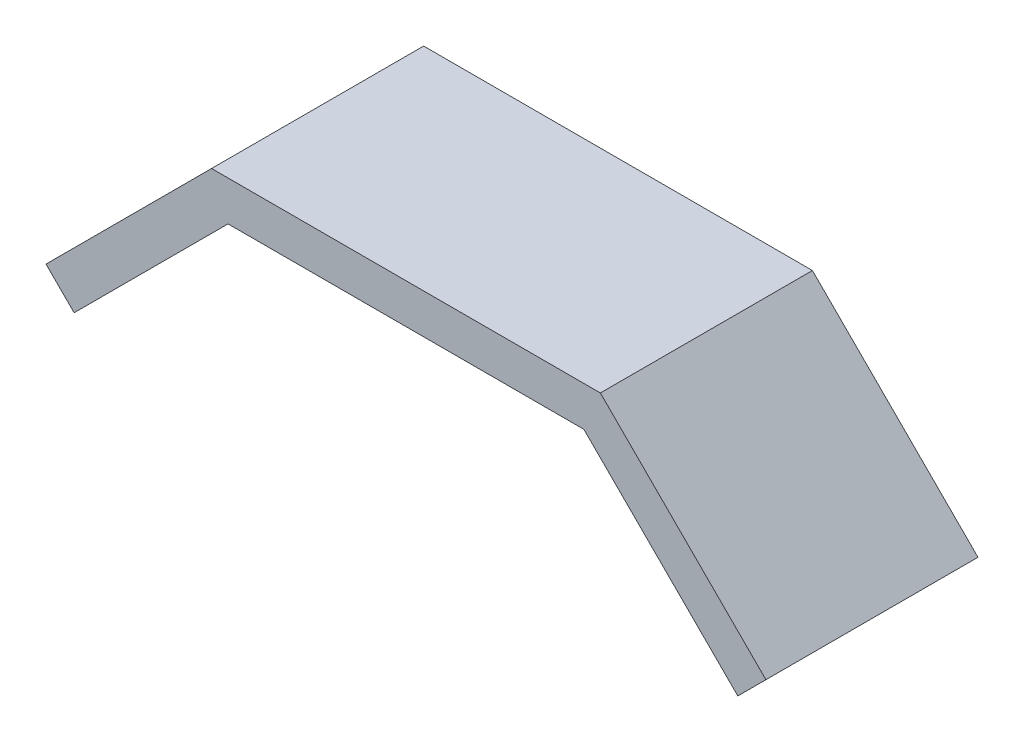
ISO-10303-21;
HEADER;
FILE_DESCRIPTION(('STEP AP214'),'2;1');
FILE_NAME('part.step','',(''),(''),'','','');
FILE_SCHEMA(('AUTOMOTIVE_DESIGN { 1 0 10303 214 1 1 1 1 }'));
ENDSEC;
DATA;
#1=APPLICATION_CONTEXT('core data for automotive mechanical design processes');
#2=APPLICATION_PROTOCOL_DEFINITION('international standard','automotive_design',2000,#1);
#3=PRODUCT_CONTEXT('',#1,'mechanical');
#4=PRODUCT('Part','Part','',(#3));
#5=PRODUCT_RELATED_PRODUCT_CATEGORY('part','',(#4));
#6=PRODUCT_DEFINITION_FORMATION('','',#4);
#7=PRODUCT_DEFINITION_CONTEXT('part definition',#1,'design');
#8=PRODUCT_DEFINITION('design','',#6,#7);
#9=PRODUCT_DEFINITION_SHAPE('','',#8);
#10=(LENGTH_UNIT() NAMED_UNIT(*) SI_UNIT(.MILLI.,.METRE.));
#11=(NAMED_UNIT(*) PLANE_ANGLE_UNIT() SI_UNIT($,.RADIAN.));
#12=(NAMED_UNIT(*) SI_UNIT($,.STERADIAN.) SOLID_ANGLE_UNIT());
#13=UNCERTAINTY_MEASURE_WITH_UNIT(LENGTH_MEASURE(1.E-05),#10,'distance_accuracy_value','');
#14=(GEOMETRIC_REPRESENTATION_CONTEXT(3) GLOBAL_UNCERTAINTY_ASSIGNED_CONTEXT((#13)) GLOBAL_UNIT_ASSIGNED_CONTEXT((#10,
#11,#12)) REPRESENTATION_CONTEXT('',''));
#15=CARTESIAN_POINT('',(0.,0.,0.));
#16=DIRECTION('',(0.,0.,1.));
#17=DIRECTION('',(1.,0.,0.));
#18=AXIS2_PLACEMENT_3D('',#15,#16,#17);
#19=CARTESIAN_POINT('',(37.6360389693211,-6.36396103067892,24.));
#20=DIRECTION('',(0.707106781186548,0.707106781186546,0.));
#21=DIRECTION('',(-0.707106781186546,0.707106781186549,0.));
#22=AXIS2_PLACEMENT_3D('',#19,#20,#21);
#23=PLANE('',#22);
#24=DIRECTION('',(0.707106781186546,-0.707106781186549,0.));
#25=VECTOR('',#24,1.);
#26=CARTESIAN_POINT('',(37.6360389693211,-6.36396103067892,-24.));
#27=LINE('',#26,#25);
#28=CARTESIAN_POINT('',(40.2720779386421,-9.,-24.));
#29=VERTEX_POINT('',#28);
#30=CARTESIAN_POINT('',(75.112698372208,-43.840620433566,-24.));
#31=VERTEX_POINT('',#30);
#32=EDGE_CURVE('E129',#29,#31,#27,.T.);
#33=ORIENTED_EDGE('',*,*,#32,.T.);
#34=DIRECTION('',(0.,0.,-1.));
#35=VECTOR('',#34,1.);
#36=CARTESIAN_POINT('',(75.112698372208,-43.840620433566,24.));
#37=LINE('',#36,#35);
#38=CARTESIAN_POINT('',(75.112698372208,-43.840620433566,24.));
#39=VERTEX_POINT('',#38);
#40=EDGE_CURVE('E11',#39,#31,#37,.T.);
#41=ORIENTED_EDGE('',*,*,#40,.F.);
#42=DIRECTION('',(0.707106781186546,-0.707106781186549,0.));
#43=VECTOR('',#42,1.);
#44=CARTESIAN_POINT('',(37.6360389693211,-6.36396103067892,24.));
#45=LINE('',#44,#43);
#46=CARTESIAN_POINT('',(40.2720779386421,-9.,24.));
#47=VERTEX_POINT('',#46);
#48=EDGE_CURVE('E87',#47,#39,#45,.T.);
#49=ORIENTED_EDGE('',*,*,#48,.F.);
#50=DIRECTION('',(0.,0.,-1.));
#51=VECTOR('',#50,1.);
#52=CARTESIAN_POINT('',(40.2720779386421,-9.,24.));
#53=LINE('',#52,#51);
#54=EDGE_CURVE('E128',#47,#29,#53,.T.);
#55=ORIENTED_EDGE('',*,*,#54,.T.);
#56=EDGE_LOOP('',(#33,#41,#49,#55));
#57=FACE_BOUND('',#56,.T.);
#58=ADVANCED_FACE('F32',(#57),#23,.F.);
#59=CARTESIAN_POINT('',(81.476659402887,-37.4766594028871,24.));
#60=DIRECTION('',(0.707106781186547,-0.707106781186548,0.));
#61=DIRECTION('',(0.707106781186548,0.707106781186547,0.));
#62=AXIS2_PLACEMENT_3D('',#59,#60,#61);
#63=PLANE('',#62);
#64=DIRECTION('',(-0.707106781186548,-0.707106781186547,0.));
#65=VECTOR('',#64,1.);
#66=CARTESIAN_POINT('',(81.476659402887,-37.4766594028871,-24.));
#67=LINE('',#66,#65);
#68=CARTESIAN_POINT('',(81.476659402887,-37.4766594028871,-24.));
#69=VERTEX_POINT('',#68);
#70=EDGE_CURVE('E132',#69,#31,#67,.T.);
#71=ORIENTED_EDGE('',*,*,#70,.F.);
#72=DIRECTION('',(0.,0.,-1.));
#73=VECTOR('',#72,1.);
#74=CARTESIAN_POINT('',(81.476659402887,-37.4766594028871,24.));
#75=LINE('',#74,#73);
#76=CARTESIAN_POINT('',(81.476659402887,-37.4766594028871,24.));
#77=VERTEX_POINT('',#76);
#78=EDGE_CURVE('E40',#77,#69,#75,.T.);
#79=ORIENTED_EDGE('',*,*,#78,.F.);
#80=DIRECTION('',(-0.707106781186548,-0.707106781186547,0.));
#81=VECTOR('',#80,1.);
#82=CARTESIAN_POINT('',(81.476659402887,-37.4766594028871,24.));
#83=LINE('',#82,#81);
#84=EDGE_CURVE('E171',#77,#39,#83,.T.);
#85=ORIENTED_EDGE('',*,*,#84,.T.);
#86=ORIENTED_EDGE('',*,*,#40,.T.);
#87=EDGE_LOOP('',(#71,#79,#85,#86));
#88=FACE_BOUND('',#87,.T.);
#89=ADVANCED_FACE('F162',(#88),#63,.T.);
#90=CARTESIAN_POINT('',(44.,0.,24.));
#91=DIRECTION('',(0.707106781186548,0.707106781186546,0.));
#92=DIRECTION('',(-0.707106781186546,0.707106781186549,0.));
#93=AXIS2_PLACEMENT_3D('',#90,#91,#92);
#94=PLANE('',#93);
#95=DIRECTION('',(0.707106781186546,-0.707106781186549,0.));
#96=VECTOR('',#95,1.);
#97=CARTESIAN_POINT('',(44.,0.,-24.));
#98=LINE('',#97,#96);
#99=CARTESIAN_POINT('',(44.,0.,-24.));
#100=VERTEX_POINT('',#99);
#101=EDGE_CURVE('E135',#100,#69,#98,.T.);
#102=ORIENTED_EDGE('',*,*,#101,.F.);
#103=DIRECTION('',(0.,0.,-1.));
#104=VECTOR('',#103,1.);
#105=CARTESIAN_POINT('',(44.,0.,24.));
#106=LINE('',#105,#104);
#107=CARTESIAN_POINT('',(44.,0.,24.));
#108=VERTEX_POINT('',#107);
#109=EDGE_CURVE('E152',#108,#100,#106,.T.);
#110=ORIENTED_EDGE('',*,*,#109,.F.);
#111=DIRECTION('',(0.707106781186546,-0.707106781186549,0.));
#112=VECTOR('',#111,1.);
#113=CARTESIAN_POINT('',(44.,0.,24.));
#114=LINE('',#113,#112);
#115=EDGE_CURVE('E159',#108,#77,#114,.T.);
#116=ORIENTED_EDGE('',*,*,#115,.T.);
#117=ORIENTED_EDGE('',*,*,#78,.T.);
#118=EDGE_LOOP('',(#102,#110,#116,#117));
#119=FACE_BOUND('',#118,.T.);
#120=ADVANCED_FACE('F157',(#119),#94,.T.);
#121=CARTESIAN_POINT('',(-44.,0.,24.));
#122=DIRECTION('',(0.,1.,0.));
#123=DIRECTION('',(0.,0.,1.));
#124=AXIS2_PLACEMENT_3D('',#121,#122,#123);
#125=PLANE('',#124);
#126=DIRECTION('',(1.,0.,0.));
#127=VECTOR('',#126,1.);
#128=CARTESIAN_POINT('',(-44.,0.,-24.));
#129=LINE('',#128,#127);
#130=CARTESIAN_POINT('',(-44.,0.,-24.));
#131=VERTEX_POINT('',#130);
#132=EDGE_CURVE('E138',#131,#100,#129,.T.);
#133=ORIENTED_EDGE('',*,*,#132,.F.);
#134=DIRECTION('',(0.,0.,-1.));
#135=VECTOR('',#134,1.);
#136=CARTESIAN_POINT('',(-44.,0.,24.));
#137=LINE('',#136,#135);
#138=CARTESIAN_POINT('',(-44.,0.,24.));
#139=VERTEX_POINT('',#138);
#140=EDGE_CURVE('E150',#139,#131,#137,.T.);
#141=ORIENTED_EDGE('',*,*,#140,.F.);
#142=DIRECTION('',(1.,0.,0.));
#143=VECTOR('',#142,1.);
#144=CARTESIAN_POINT('',(-44.,0.,24.));
#145=LINE('',#144,#143);
#146=EDGE_CURVE('E123',#139,#108,#145,.T.);
#147=ORIENTED_EDGE('',*,*,#146,.T.);
#148=ORIENTED_EDGE('',*,*,#109,.T.);
#149=EDGE_LOOP('',(#133,#141,#147,#148));
#150=FACE_BOUND('',#149,.T.);
#151=ADVANCED_FACE('F169',(#150),#125,.T.);
#152=CARTESIAN_POINT('',(-81.4766594028869,-37.4766594028871,24.));
#153=DIRECTION('',(-0.707106781186549,0.707106781186546,0.));
#154=DIRECTION('',(-0.707106781186546,-0.707106781186549,0.));
#155=AXIS2_PLACEMENT_3D('',#152,#153,#154);
#156=PLANE('',#155);
#157=DIRECTION('',(0.707106781186546,0.707106781186549,0.));
#158=VECTOR('',#157,1.);
#159=CARTESIAN_POINT('',(-81.4766594028869,-37.4766594028871,-24.));
#160=LINE('',#159,#158);
#161=CARTESIAN_POINT('',(-81.4766594028869,-37.4766594028871,-24.));
#162=VERTEX_POINT('',#161);
#163=EDGE_CURVE('E141',#162,#131,#160,.T.);
#164=ORIENTED_EDGE('',*,*,#163,.F.);
#165=DIRECTION('',(0.,0.,-1.));
#166=VECTOR('',#165,1.);
#167=CARTESIAN_POINT('',(-81.4766594028869,-37.4766594028871,24.));
#168=LINE('',#167,#166);
#169=CARTESIAN_POINT('',(-81.4766594028869,-37.4766594028871,24.));
#170=VERTEX_POINT('',#169);
#171=EDGE_CURVE('E111',#170,#162,#168,.T.);
#172=ORIENTED_EDGE('',*,*,#171,.F.);
#173=DIRECTION('',(0.707106781186546,0.707106781186549,0.));
#174=VECTOR('',#173,1.);
#175=CARTESIAN_POINT('',(-81.4766594028869,-37.4766594028871,24.));
#176=LINE('',#175,#174);
#177=EDGE_CURVE('E121',#170,#139,#176,.T.);
#178=ORIENTED_EDGE('',*,*,#177,.T.);
#179=ORIENTED_EDGE('',*,*,#140,.T.);
#180=EDGE_LOOP('',(#164,#172,#178,#179));
#181=FACE_BOUND('',#180,.T.);
#182=ADVANCED_FACE('F176',(#181),#156,.T.);
#183=CARTESIAN_POINT('',(-75.112698372208,-43.840620433566,24.));
#184=DIRECTION('',(-0.707106781186546,-0.707106781186549,0.));
#185=DIRECTION('',(0.707106781186549,-0.707106781186546,0.));
#186=AXIS2_PLACEMENT_3D('',#183,#184,#185);
#187=PLANE('',#186);
#188=DIRECTION('',(-0.707106781186549,0.707106781186546,0.));
#189=VECTOR('',#188,1.);
#190=CARTESIAN_POINT('',(-75.112698372208,-43.840620433566,-24.));
#191=LINE('',#190,#189);
#192=CARTESIAN_POINT('',(-75.112698372208,-43.840620433566,-24.));
#193=VERTEX_POINT('',#192);
#194=EDGE_CURVE('E110',#193,#162,#191,.T.);
#195=ORIENTED_EDGE('',*,*,#194,.F.);
#196=DIRECTION('',(0.,0.,-1.));
#197=VECTOR('',#196,1.);
#198=CARTESIAN_POINT('',(-75.112698372208,-43.840620433566,24.));
#199=LINE('',#198,#197);
#200=CARTESIAN_POINT('',(-75.112698372208,-43.840620433566,24.));
#201=VERTEX_POINT('',#200);
#202=EDGE_CURVE('E104',#201,#193,#199,.T.);
#203=ORIENTED_EDGE('',*,*,#202,.F.);
#204=DIRECTION('',(-0.707106781186549,0.707106781186546,0.));
#205=VECTOR('',#204,1.);
#206=CARTESIAN_POINT('',(-75.112698372208,-43.840620433566,24.));
#207=LINE('',#206,#205);
#208=EDGE_CURVE('E108',#201,#170,#207,.T.);
#209=ORIENTED_EDGE('',*,*,#208,.T.);
#210=ORIENTED_EDGE('',*,*,#171,.T.);
#211=EDGE_LOOP('',(#195,#203,#209,#210));
#212=FACE_BOUND('',#211,.T.);
#213=ADVANCED_FACE('F106',(#212),#187,.T.);
#214=CARTESIAN_POINT('',(-75.112698372208,-43.840620433566,24.));
#215=DIRECTION('',(-0.707106781186549,0.707106781186546,0.));
#216=DIRECTION('',(-0.707106781186546,-0.707106781186549,0.));
#217=AXIS2_PLACEMENT_3D('',#214,#215,#216);
#218=PLANE('',#217);
#219=DIRECTION('',(0.707106781186546,0.707106781186549,0.));
#220=VECTOR('',#219,1.);
#221=CARTESIAN_POINT('',(-75.112698372208,-43.840620433566,-24.));
#222=LINE('',#221,#220);
#223=CARTESIAN_POINT('',(-40.2720779386421,-9.,-24.));
#224=VERTEX_POINT('',#223);
#225=EDGE_CURVE('E75',#193,#224,#222,.T.);
#226=ORIENTED_EDGE('',*,*,#225,.T.);
#227=DIRECTION('',(0.,0.,-1.));
#228=VECTOR('',#227,1.);
#229=CARTESIAN_POINT('',(-40.2720779386421,-9.,24.));
#230=LINE('',#229,#228);
#231=CARTESIAN_POINT('',(-40.2720779386421,-9.,24.));
#232=VERTEX_POINT('',#231);
#233=EDGE_CURVE('E112',#232,#224,#230,.T.);
#234=ORIENTED_EDGE('',*,*,#233,.F.);
#235=DIRECTION('',(0.707106781186546,0.707106781186549,0.));
#236=VECTOR('',#235,1.);
#237=CARTESIAN_POINT('',(-75.112698372208,-43.840620433566,24.));
#238=LINE('',#237,#236);
#239=EDGE_CURVE('E114',#201,#232,#238,.T.);
#240=ORIENTED_EDGE('',*,*,#239,.F.);
#241=ORIENTED_EDGE('',*,*,#202,.T.);
#242=EDGE_LOOP('',(#226,#234,#240,#241));
#243=FACE_BOUND('',#242,.T.);
#244=ADVANCED_FACE('F115',(#243),#218,.F.);
#245=CARTESIAN_POINT('',(-44.,-9.,24.));
#246=DIRECTION('',(0.,1.,0.));
#247=DIRECTION('',(0.,0.,1.));
#248=AXIS2_PLACEMENT_3D('',#245,#246,#247);
#249=PLANE('',#248);
#250=DIRECTION('',(1.,0.,0.));
#251=VECTOR('',#250,1.);
#252=CARTESIAN_POINT('',(-44.,-9.,-24.));
#253=LINE('',#252,#251);
#254=EDGE_CURVE('E81',#224,#29,#253,.T.);
#255=ORIENTED_EDGE('',*,*,#254,.T.);
#256=ORIENTED_EDGE('',*,*,#54,.F.);
#257=DIRECTION('',(1.,0.,0.));
#258=VECTOR('',#257,1.);
#259=CARTESIAN_POINT('',(-44.,-9.,24.));
#260=LINE('',#259,#258);
#261=EDGE_CURVE('E48',#232,#47,#260,.T.);
#262=ORIENTED_EDGE('',*,*,#261,.F.);
#263=ORIENTED_EDGE('',*,*,#233,.T.);
#264=EDGE_LOOP('',(#255,#256,#262,#263));
#265=FACE_BOUND('',#264,.T.);
#266=ADVANCED_FACE('F178',(#265),#249,.F.);
#267=CARTESIAN_POINT('',(0.,0.,24.));
#268=DIRECTION('',(0.,0.,-1.));
#269=DIRECTION('',(-1.,0.,0.));
#270=AXIS2_PLACEMENT_3D('',#267,#268,#269);
#271=PLANE('',#270);
#272=ORIENTED_EDGE('',*,*,#48,.T.);
#273=ORIENTED_EDGE('',*,*,#84,.F.);
#274=ORIENTED_EDGE('',*,*,#115,.F.);
#275=ORIENTED_EDGE('',*,*,#146,.F.);
#276=ORIENTED_EDGE('',*,*,#177,.F.);
#277=ORIENTED_EDGE('',*,*,#208,.F.);
#278=ORIENTED_EDGE('',*,*,#239,.T.);
#279=ORIENTED_EDGE('',*,*,#261,.T.);
#280=EDGE_LOOP('',(#272,#273,#274,#275,#276,#277,#278,#279));
#281=FACE_BOUND('',#280,.T.);
#282=ADVANCED_FACE('F118',(#281),#271,.F.);
#283=CARTESIAN_POINT('',(0.,0.,-24.));
#284=DIRECTION('',(0.,0.,-1.));
#285=DIRECTION('',(-1.,0.,0.));
#286=AXIS2_PLACEMENT_3D('',#283,#284,#285);
#287=PLANE('',#286);
#288=ORIENTED_EDGE('',*,*,#32,.F.);
#289=ORIENTED_EDGE('',*,*,#254,.F.);
#290=ORIENTED_EDGE('',*,*,#225,.F.);
#291=ORIENTED_EDGE('',*,*,#194,.T.);
#292=ORIENTED_EDGE('',*,*,#163,.T.);
#293=ORIENTED_EDGE('',*,*,#132,.T.);
#294=ORIENTED_EDGE('',*,*,#101,.T.);
#295=ORIENTED_EDGE('',*,*,#70,.T.);
#296=EDGE_LOOP('',(#288,#289,#290,#291,#292,#293,#294,#295));
#297=FACE_BOUND('',#296,.T.);
#298=ADVANCED_FACE('F165',(#297),#287,.T.);
#299=CLOSED_SHELL('',(#58,#89,#120,#151,#182,#213,#244,#266,#282,#298));
#300=MANIFOLD_SOLID_BREP('B2',#299);
#301=ADVANCED_BREP_SHAPE_REPRESENTATION('',(#18,#300),#14);
#302=SHAPE_DEFINITION_REPRESENTATION(#9,#301);
ENDSEC;
END-ISO-10303-21;
